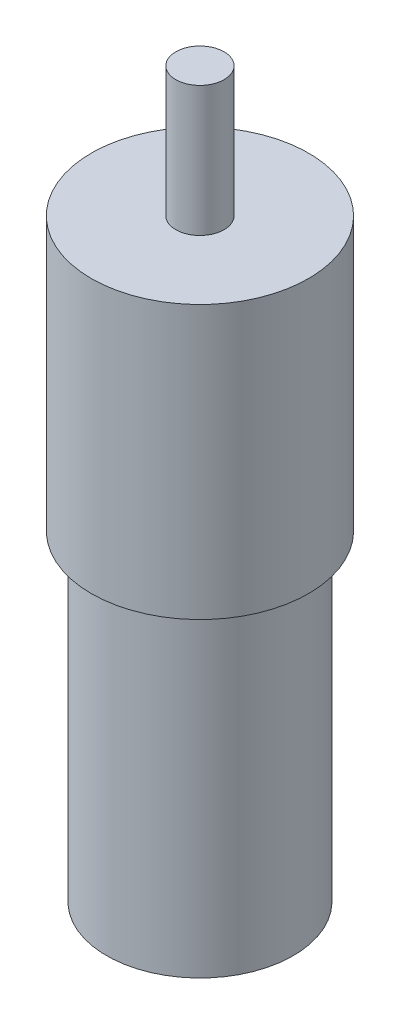
ISO-10303-21;
HEADER;
FILE_DESCRIPTION(('STEP AP214'),'2;1');
FILE_NAME('part.step','',(''),(''),'','','');
FILE_SCHEMA(('AUTOMOTIVE_DESIGN { 1 0 10303 214 1 1 1 1 }'));
ENDSEC;
DATA;
#1=APPLICATION_CONTEXT('core data for automotive mechanical design processes');
#2=APPLICATION_PROTOCOL_DEFINITION('international standard','automotive_design',2000,#1);
#3=PRODUCT_CONTEXT('',#1,'mechanical');
#4=PRODUCT('Part','Part','',(#3));
#5=PRODUCT_RELATED_PRODUCT_CATEGORY('part','',(#4));
#6=PRODUCT_DEFINITION_FORMATION('','',#4);
#7=PRODUCT_DEFINITION_CONTEXT('part definition',#1,'design');
#8=PRODUCT_DEFINITION('design','',#6,#7);
#9=PRODUCT_DEFINITION_SHAPE('','',#8);
#10=(LENGTH_UNIT() NAMED_UNIT(*) SI_UNIT(.MILLI.,.METRE.));
#11=(NAMED_UNIT(*) PLANE_ANGLE_UNIT() SI_UNIT($,.RADIAN.));
#12=(NAMED_UNIT(*) SI_UNIT($,.STERADIAN.) SOLID_ANGLE_UNIT());
#13=UNCERTAINTY_MEASURE_WITH_UNIT(LENGTH_MEASURE(1.E-05),#10,'distance_accuracy_value','');
#14=(GEOMETRIC_REPRESENTATION_CONTEXT(3) GLOBAL_UNCERTAINTY_ASSIGNED_CONTEXT((#13)) GLOBAL_UNIT_ASSIGNED_CONTEXT((#10,
#11,#12)) REPRESENTATION_CONTEXT('',''));
#15=CARTESIAN_POINT('',(0.,0.,0.));
#16=DIRECTION('',(0.,0.,1.));
#17=DIRECTION('',(1.,0.,0.));
#18=AXIS2_PLACEMENT_3D('',#15,#16,#17);
#19=CARTESIAN_POINT('',(0.,56.515,0.));
#20=DIRECTION('',(0.,-1.,0.));
#21=DIRECTION('',(0.,0.,-1.));
#22=AXIS2_PLACEMENT_3D('',#19,#20,#21);
#23=CYLINDRICAL_SURFACE('',#22,22.5044);
#24=CARTESIAN_POINT('',(0.,56.515,0.));
#25=DIRECTION('',(0.,1.,0.));
#26=DIRECTION('',(0.,0.,1.));
#27=AXIS2_PLACEMENT_3D('',#24,#25,#26);
#28=CIRCLE('',#27,22.5044);
#29=CARTESIAN_POINT('',(0.,56.515,22.5044));
#30=VERTEX_POINT('',#29);
#31=EDGE_CURVE('E42',#30,#30,#28,.T.);
#32=ORIENTED_EDGE('',*,*,#31,.F.);
#33=EDGE_LOOP('',(#32));
#34=FACE_BOUND('',#33,.T.);
#35=CARTESIAN_POINT('',(0.,0.,0.));
#36=DIRECTION('',(0.,1.,0.));
#37=DIRECTION('',(0.,0.,1.));
#38=AXIS2_PLACEMENT_3D('',#35,#36,#37);
#39=CIRCLE('',#38,22.5044);
#40=CARTESIAN_POINT('',(0.,0.,22.5044));
#41=VERTEX_POINT('',#40);
#42=EDGE_CURVE('E33',#41,#41,#39,.T.);
#43=ORIENTED_EDGE('',*,*,#42,.T.);
#44=EDGE_LOOP('',(#43));
#45=FACE_BOUND('',#44,.T.);
#46=ADVANCED_FACE('F30',(#34,#45),#23,.T.);
#47=CARTESIAN_POINT('',(0.,56.515,0.));
#48=DIRECTION('',(0.,1.,0.));
#49=DIRECTION('',(0.,0.,1.));
#50=AXIS2_PLACEMENT_3D('',#47,#48,#49);
#51=PLANE('',#50);
#52=CARTESIAN_POINT('',(0.,56.515,0.));
#53=DIRECTION('',(0.,1.,0.));
#54=DIRECTION('',(0.,0.,1.));
#55=AXIS2_PLACEMENT_3D('',#52,#53,#54);
#56=CIRCLE('',#55,4.99999);
#57=CARTESIAN_POINT('',(0.,56.515,4.99999));
#58=VERTEX_POINT('',#57);
#59=EDGE_CURVE('E37',#58,#58,#56,.T.);
#60=ORIENTED_EDGE('',*,*,#59,.F.);
#61=EDGE_LOOP('',(#60));
#62=FACE_BOUND('',#61,.T.);
#63=ORIENTED_EDGE('',*,*,#31,.T.);
#64=EDGE_LOOP('',(#63));
#65=FACE_BOUND('',#64,.T.);
#66=ADVANCED_FACE('F59',(#62,#65),#51,.T.);
#67=CARTESIAN_POINT('',(0.,0.,0.));
#68=DIRECTION('',(0.,1.,0.));
#69=DIRECTION('',(0.,0.,1.));
#70=AXIS2_PLACEMENT_3D('',#67,#68,#69);
#71=PLANE('',#70);
#72=CARTESIAN_POINT('',(0.,0.,0.));
#73=DIRECTION('',(0.,-1.,0.));
#74=DIRECTION('',(0.,0.,-1.));
#75=AXIS2_PLACEMENT_3D('',#72,#73,#74);
#76=CIRCLE('',#75,19.3294);
#77=CARTESIAN_POINT('',(0.,0.,-19.3294));
#78=VERTEX_POINT('',#77);
#79=EDGE_CURVE('E10',#78,#78,#76,.T.);
#80=ORIENTED_EDGE('',*,*,#79,.F.);
#81=EDGE_LOOP('',(#80));
#82=FACE_BOUND('',#81,.T.);
#83=ORIENTED_EDGE('',*,*,#42,.F.);
#84=EDGE_LOOP('',(#83));
#85=FACE_BOUND('',#84,.T.);
#86=ADVANCED_FACE('F56',(#82,#85),#71,.F.);
#87=CARTESIAN_POINT('',(0.,83.439,0.));
#88=DIRECTION('',(0.,-1.,0.));
#89=DIRECTION('',(0.,0.,-1.));
#90=AXIS2_PLACEMENT_3D('',#87,#88,#89);
#91=CYLINDRICAL_SURFACE('',#90,4.99999);
#92=CARTESIAN_POINT('',(0.,83.439,0.));
#93=DIRECTION('',(0.,1.,0.));
#94=DIRECTION('',(0.,0.,1.));
#95=AXIS2_PLACEMENT_3D('',#92,#93,#94);
#96=CIRCLE('',#95,4.99999);
#97=CARTESIAN_POINT('',(0.,83.439,4.99999));
#98=VERTEX_POINT('',#97);
#99=EDGE_CURVE('E47',#98,#98,#96,.T.);
#100=ORIENTED_EDGE('',*,*,#99,.F.);
#101=EDGE_LOOP('',(#100));
#102=FACE_BOUND('',#101,.T.);
#103=ORIENTED_EDGE('',*,*,#59,.T.);
#104=EDGE_LOOP('',(#103));
#105=FACE_BOUND('',#104,.T.);
#106=ADVANCED_FACE('F58',(#102,#105),#91,.T.);
#107=CARTESIAN_POINT('',(0.,83.439,0.));
#108=DIRECTION('',(0.,1.,0.));
#109=DIRECTION('',(0.,0.,1.));
#110=AXIS2_PLACEMENT_3D('',#107,#108,#109);
#111=PLANE('',#110);
#112=ORIENTED_EDGE('',*,*,#99,.T.);
#113=EDGE_LOOP('',(#112));
#114=FACE_BOUND('',#113,.T.);
#115=ADVANCED_FACE('F65',(#114),#111,.T.);
#116=CARTESIAN_POINT('',(0.,-66.548,0.));
#117=DIRECTION('',(0.,1.,0.));
#118=DIRECTION('',(0.,0.,1.));
#119=AXIS2_PLACEMENT_3D('',#116,#117,#118);
#120=CYLINDRICAL_SURFACE('',#119,19.3294);
#121=CARTESIAN_POINT('',(0.,-66.548,0.));
#122=DIRECTION('',(0.,-1.,0.));
#123=DIRECTION('',(0.,0.,-1.));
#124=AXIS2_PLACEMENT_3D('',#121,#122,#123);
#125=CIRCLE('',#124,19.3294);
#126=CARTESIAN_POINT('',(0.,-66.548,-19.3294));
#127=VERTEX_POINT('',#126);
#128=EDGE_CURVE('E46',#127,#127,#125,.T.);
#129=ORIENTED_EDGE('',*,*,#128,.F.);
#130=EDGE_LOOP('',(#129));
#131=FACE_BOUND('',#130,.T.);
#132=ORIENTED_EDGE('',*,*,#79,.T.);
#133=EDGE_LOOP('',(#132));
#134=FACE_BOUND('',#133,.T.);
#135=ADVANCED_FACE('F93',(#131,#134),#120,.T.);
#136=CARTESIAN_POINT('',(0.,-66.548,0.));
#137=DIRECTION('',(0.,-1.,0.));
#138=DIRECTION('',(0.,0.,-1.));
#139=AXIS2_PLACEMENT_3D('',#136,#137,#138);
#140=PLANE('',#139);
#141=ORIENTED_EDGE('',*,*,#128,.T.);
#142=EDGE_LOOP('',(#141));
#143=FACE_BOUND('',#142,.T.);
#144=ADVANCED_FACE('F107',(#143),#140,.T.);
#145=CLOSED_SHELL('',(#46,#66,#86,#106,#115,#135,#144));
#146=MANIFOLD_SOLID_BREP('B2',#145);
#147=ADVANCED_BREP_SHAPE_REPRESENTATION('',(#18,#146),#14);
#148=SHAPE_DEFINITION_REPRESENTATION(#9,#147);
ENDSEC;
END-ISO-10303-21;
